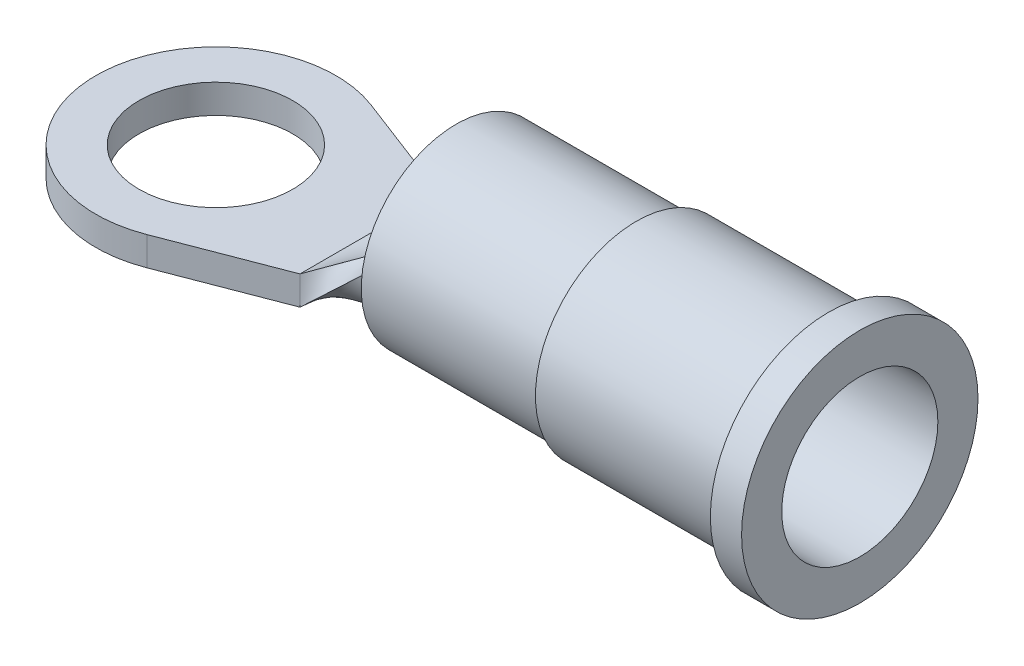
ISO-10303-21;
HEADER;
FILE_DESCRIPTION(('STEP AP214'),'2;1');
FILE_NAME('part.step','',(''),(''),'','','');
FILE_SCHEMA(('AUTOMOTIVE_DESIGN { 1 0 10303 214 1 1 1 1 }'));
ENDSEC;
DATA;
#1=APPLICATION_CONTEXT('core data for automotive mechanical design processes');
#2=APPLICATION_PROTOCOL_DEFINITION('international standard','automotive_design',2000,#1);
#3=PRODUCT_CONTEXT('',#1,'mechanical');
#4=PRODUCT('Part','Part','',(#3));
#5=PRODUCT_RELATED_PRODUCT_CATEGORY('part','',(#4));
#6=PRODUCT_DEFINITION_FORMATION('','',#4);
#7=PRODUCT_DEFINITION_CONTEXT('part definition',#1,'design');
#8=PRODUCT_DEFINITION('design','',#6,#7);
#9=PRODUCT_DEFINITION_SHAPE('','',#8);
#10=(LENGTH_UNIT() NAMED_UNIT(*) SI_UNIT(.MILLI.,.METRE.));
#11=(NAMED_UNIT(*) PLANE_ANGLE_UNIT() SI_UNIT($,.RADIAN.));
#12=(NAMED_UNIT(*) SI_UNIT($,.STERADIAN.) SOLID_ANGLE_UNIT());
#13=UNCERTAINTY_MEASURE_WITH_UNIT(LENGTH_MEASURE(1.E-05),#10,'distance_accuracy_value','');
#14=(GEOMETRIC_REPRESENTATION_CONTEXT(3) GLOBAL_UNCERTAINTY_ASSIGNED_CONTEXT((#13)) GLOBAL_UNIT_ASSIGNED_CONTEXT((#10,
#11,#12)) REPRESENTATION_CONTEXT('',''));
#15=CARTESIAN_POINT('',(0.,0.,0.));
#16=DIRECTION('',(0.,0.,1.));
#17=DIRECTION('',(1.,0.,0.));
#18=AXIS2_PLACEMENT_3D('',#15,#16,#17);
#19=CARTESIAN_POINT('',(6.35,3.65125,0.));
#20=DIRECTION('',(-1.,0.,0.));
#21=DIRECTION('',(0.,0.,1.));
#22=AXIS2_PLACEMENT_3D('',#19,#20,#21);
#23=PLANE('',#22);
#24=CARTESIAN_POINT('',(6.35,1.143,0.));
#25=DIRECTION('',(1.,0.,0.));
#26=DIRECTION('',(0.,0.,-1.));
#27=AXIS2_PLACEMENT_3D('',#24,#25,#26);
#28=CIRCLE('',#27,1.905);
#29=CARTESIAN_POINT('',(6.35,1.143,-1.905));
#30=VERTEX_POINT('',#29);
#31=EDGE_CURVE('E276',#30,#30,#28,.T.);
#32=ORIENTED_EDGE('',*,*,#31,.T.);
#33=EDGE_LOOP('',(#32));
#34=FACE_BOUND('',#33,.T.);
#35=CARTESIAN_POINT('',(6.35,1.143,0.));
#36=DIRECTION('',(1.,0.,0.));
#37=DIRECTION('',(0.,0.,-1.));
#38=AXIS2_PLACEMENT_3D('',#35,#36,#37);
#39=CIRCLE('',#38,2.50825);
#40=CARTESIAN_POINT('',(6.35,1.143,-2.50825));
#41=VERTEX_POINT('',#40);
#42=EDGE_CURVE('E12',#41,#41,#39,.T.);
#43=ORIENTED_EDGE('',*,*,#42,.F.);
#44=EDGE_LOOP('',(#43));
#45=FACE_BOUND('',#44,.T.);
#46=ADVANCED_FACE('F242',(#34,#45),#23,.T.);
#47=CARTESIAN_POINT('',(13.1723727210182,1.143,0.));
#48=DIRECTION('',(1.,0.,0.));
#49=DIRECTION('',(0.,0.,-1.));
#50=AXIS2_PLACEMENT_3D('',#47,#48,#49);
#51=CYLINDRICAL_SURFACE('',#50,2.50825);
#52=ORIENTED_EDGE('',*,*,#42,.T.);
#53=EDGE_LOOP('',(#52));
#54=FACE_BOUND('',#53,.T.);
#55=CARTESIAN_POINT('',(11.1125,1.143,0.));
#56=DIRECTION('',(1.,0.,0.));
#57=DIRECTION('',(0.,0.,-1.));
#58=AXIS2_PLACEMENT_3D('',#55,#56,#57);
#59=CIRCLE('',#58,2.50825);
#60=CARTESIAN_POINT('',(11.1125,1.143,-2.50825));
#61=VERTEX_POINT('',#60);
#62=EDGE_CURVE('E248',#61,#61,#59,.T.);
#63=ORIENTED_EDGE('',*,*,#62,.F.);
#64=EDGE_LOOP('',(#63));
#65=FACE_BOUND('',#64,.T.);
#66=ADVANCED_FACE('F294',(#54,#65),#51,.T.);
#67=CARTESIAN_POINT('',(11.1125,3.81,0.));
#68=DIRECTION('',(-1.,0.,0.));
#69=DIRECTION('',(0.,0.,1.));
#70=AXIS2_PLACEMENT_3D('',#67,#68,#69);
#71=PLANE('',#70);
#72=ORIENTED_EDGE('',*,*,#62,.T.);
#73=EDGE_LOOP('',(#72));
#74=FACE_BOUND('',#73,.T.);
#75=CARTESIAN_POINT('',(11.1125,1.143,0.));
#76=DIRECTION('',(1.,0.,0.));
#77=DIRECTION('',(0.,0.,-1.));
#78=AXIS2_PLACEMENT_3D('',#75,#76,#77);
#79=CIRCLE('',#78,2.667);
#80=CARTESIAN_POINT('',(11.1125,1.143,-2.667));
#81=VERTEX_POINT('',#80);
#82=EDGE_CURVE('E252',#81,#81,#79,.T.);
#83=ORIENTED_EDGE('',*,*,#82,.F.);
#84=EDGE_LOOP('',(#83));
#85=FACE_BOUND('',#84,.T.);
#86=ADVANCED_FACE('F298',(#74,#85),#71,.T.);
#87=CARTESIAN_POINT('',(13.1723727210182,1.143,0.));
#88=DIRECTION('',(1.,0.,0.));
#89=DIRECTION('',(0.,0.,-1.));
#90=AXIS2_PLACEMENT_3D('',#87,#88,#89);
#91=CYLINDRICAL_SURFACE('',#90,2.667);
#92=ORIENTED_EDGE('',*,*,#82,.T.);
#93=EDGE_LOOP('',(#92));
#94=FACE_BOUND('',#93,.T.);
#95=CARTESIAN_POINT('',(16.1925,1.143,0.));
#96=DIRECTION('',(1.,0.,0.));
#97=DIRECTION('',(0.,0.,-1.));
#98=AXIS2_PLACEMENT_3D('',#95,#96,#97);
#99=CIRCLE('',#98,2.667);
#100=CARTESIAN_POINT('',(16.1925,1.143,-2.667));
#101=VERTEX_POINT('',#100);
#102=EDGE_CURVE('E256',#101,#101,#99,.T.);
#103=ORIENTED_EDGE('',*,*,#102,.F.);
#104=EDGE_LOOP('',(#103));
#105=FACE_BOUND('',#104,.T.);
#106=ADVANCED_FACE('F302',(#94,#105),#91,.T.);
#107=CARTESIAN_POINT('',(16.1925,3.81,0.));
#108=DIRECTION('',(-1.,0.,0.));
#109=DIRECTION('',(0.,0.,1.));
#110=AXIS2_PLACEMENT_3D('',#107,#108,#109);
#111=PLANE('',#110);
#112=ORIENTED_EDGE('',*,*,#102,.T.);
#113=EDGE_LOOP('',(#112));
#114=FACE_BOUND('',#113,.T.);
#115=CARTESIAN_POINT('',(16.1925,1.143,0.));
#116=DIRECTION('',(1.,0.,0.));
#117=DIRECTION('',(0.,0.,-1.));
#118=AXIS2_PLACEMENT_3D('',#115,#116,#117);
#119=CIRCLE('',#118,3.1242);
#120=CARTESIAN_POINT('',(16.1925,1.143,-3.1242));
#121=VERTEX_POINT('',#120);
#122=EDGE_CURVE('E261',#121,#121,#119,.T.);
#123=ORIENTED_EDGE('',*,*,#122,.F.);
#124=EDGE_LOOP('',(#123));
#125=FACE_BOUND('',#124,.T.);
#126=ADVANCED_FACE('F308',(#114,#125),#111,.T.);
#127=CARTESIAN_POINT('',(13.1723727210182,1.143,0.));
#128=DIRECTION('',(1.,0.,0.));
#129=DIRECTION('',(0.,0.,-1.));
#130=AXIS2_PLACEMENT_3D('',#127,#128,#129);
#131=CYLINDRICAL_SURFACE('',#130,3.1242);
#132=ORIENTED_EDGE('',*,*,#122,.T.);
#133=EDGE_LOOP('',(#132));
#134=FACE_BOUND('',#133,.T.);
#135=CARTESIAN_POINT('',(17.018,1.143,0.));
#136=DIRECTION('',(1.,0.,0.));
#137=DIRECTION('',(0.,0.,-1.));
#138=AXIS2_PLACEMENT_3D('',#135,#136,#137);
#139=CIRCLE('',#138,3.1242);
#140=CARTESIAN_POINT('',(17.018,1.143,-3.1242));
#141=VERTEX_POINT('',#140);
#142=EDGE_CURVE('E264',#141,#141,#139,.T.);
#143=ORIENTED_EDGE('',*,*,#142,.F.);
#144=EDGE_LOOP('',(#143));
#145=FACE_BOUND('',#144,.T.);
#146=ADVANCED_FACE('F312',(#134,#145),#131,.T.);
#147=CARTESIAN_POINT('',(17.018,3.20675,0.));
#148=DIRECTION('',(1.,0.,0.));
#149=DIRECTION('',(0.,0.,-1.));
#150=AXIS2_PLACEMENT_3D('',#147,#148,#149);
#151=PLANE('',#150);
#152=ORIENTED_EDGE('',*,*,#142,.T.);
#153=EDGE_LOOP('',(#152));
#154=FACE_BOUND('',#153,.T.);
#155=CARTESIAN_POINT('',(17.018,1.143,0.));
#156=DIRECTION('',(1.,0.,0.));
#157=DIRECTION('',(0.,0.,-1.));
#158=AXIS2_PLACEMENT_3D('',#155,#156,#157);
#159=CIRCLE('',#158,2.06375);
#160=CARTESIAN_POINT('',(17.018,1.143,-2.06375));
#161=VERTEX_POINT('',#160);
#162=EDGE_CURVE('E267',#161,#161,#159,.T.);
#163=ORIENTED_EDGE('',*,*,#162,.F.);
#164=EDGE_LOOP('',(#163));
#165=FACE_BOUND('',#164,.T.);
#166=ADVANCED_FACE('F316',(#154,#165),#151,.T.);
#167=CARTESIAN_POINT('',(13.1723727210182,1.143,0.));
#168=DIRECTION('',(1.,0.,0.));
#169=DIRECTION('',(0.,0.,-1.));
#170=AXIS2_PLACEMENT_3D('',#167,#168,#169);
#171=CYLINDRICAL_SURFACE('',#170,2.06375);
#172=ORIENTED_EDGE('',*,*,#162,.T.);
#173=EDGE_LOOP('',(#172));
#174=FACE_BOUND('',#173,.T.);
#175=CARTESIAN_POINT('',(12.7,1.143,0.));
#176=DIRECTION('',(1.,0.,0.));
#177=DIRECTION('',(0.,0.,-1.));
#178=AXIS2_PLACEMENT_3D('',#175,#176,#177);
#179=CIRCLE('',#178,2.06375);
#180=CARTESIAN_POINT('',(12.7,1.143,-2.06375));
#181=VERTEX_POINT('',#180);
#182=EDGE_CURVE('E270',#181,#181,#179,.T.);
#183=ORIENTED_EDGE('',*,*,#182,.F.);
#184=EDGE_LOOP('',(#183));
#185=FACE_BOUND('',#184,.T.);
#186=ADVANCED_FACE('F290',(#174,#185),#171,.F.);
#187=CARTESIAN_POINT('',(12.7,3.048,0.));
#188=DIRECTION('',(1.,0.,0.));
#189=DIRECTION('',(0.,0.,-1.));
#190=AXIS2_PLACEMENT_3D('',#187,#188,#189);
#191=PLANE('',#190);
#192=ORIENTED_EDGE('',*,*,#182,.T.);
#193=EDGE_LOOP('',(#192));
#194=FACE_BOUND('',#193,.T.);
#195=CARTESIAN_POINT('',(12.7,1.143,0.));
#196=DIRECTION('',(1.,0.,0.));
#197=DIRECTION('',(0.,0.,-1.));
#198=AXIS2_PLACEMENT_3D('',#195,#196,#197);
#199=CIRCLE('',#198,1.905);
#200=CARTESIAN_POINT('',(12.7,1.143,-1.905));
#201=VERTEX_POINT('',#200);
#202=EDGE_CURVE('E273',#201,#201,#199,.T.);
#203=ORIENTED_EDGE('',*,*,#202,.F.);
#204=EDGE_LOOP('',(#203));
#205=FACE_BOUND('',#204,.T.);
#206=ADVANCED_FACE('F284',(#194,#205),#191,.T.);
#207=CARTESIAN_POINT('',(13.1723727210182,1.143,0.));
#208=DIRECTION('',(1.,0.,0.));
#209=DIRECTION('',(0.,0.,-1.));
#210=AXIS2_PLACEMENT_3D('',#207,#208,#209);
#211=CYLINDRICAL_SURFACE('',#210,1.905);
#212=ORIENTED_EDGE('',*,*,#202,.T.);
#213=EDGE_LOOP('',(#212));
#214=FACE_BOUND('',#213,.T.);
#215=ORIENTED_EDGE('',*,*,#31,.F.);
#216=EDGE_LOOP('',(#215));
#217=FACE_BOUND('',#216,.T.);
#218=ADVANCED_FACE('F282',(#214,#217),#211,.F.);
#219=CLOSED_SHELL('',(#46,#66,#86,#106,#126,#146,#166,#186,#206,#218));
#220=MANIFOLD_SOLID_BREP('B2',#219);
#221=CARTESIAN_POINT('',(4.064,-0.762,-1.8415));
#222=DIRECTION('',(0.358190515399046,0.,-0.933648517740036));
#223=DIRECTION('',(-0.933648517740036,0.,-0.358190515399046));
#224=AXIS2_PLACEMENT_3D('',#221,#222,#223);
#225=PLANE('',#224);
#226=DIRECTION('',(-0.933648517740036,0.,-0.358190515399046));
#227=VECTOR('',#226,1.);
#228=CARTESIAN_POINT('',(4.064,0.,-1.8415));
#229=LINE('',#228,#227);
#230=CARTESIAN_POINT('',(4.064,0.,-1.8415));
#231=VERTEX_POINT('',#230);
#232=CARTESIAN_POINT('',(1.13725488639197,0.,-2.96433404382461));
#233=VERTEX_POINT('',#232);
#234=EDGE_CURVE('E546',#231,#233,#229,.T.);
#235=ORIENTED_EDGE('',*,*,#234,.F.);
#236=DIRECTION('',(0.,1.,0.));
#237=VECTOR('',#236,1.);
#238=CARTESIAN_POINT('',(4.064,-0.762,-1.8415));
#239=LINE('',#238,#237);
#240=CARTESIAN_POINT('',(4.064,-0.762,-1.8415));
#241=VERTEX_POINT('',#240);
#242=EDGE_CURVE('E240',#241,#231,#239,.T.);
#243=ORIENTED_EDGE('',*,*,#242,.F.);
#244=DIRECTION('',(-0.933648517740036,0.,-0.358190515399046));
#245=VECTOR('',#244,1.);
#246=CARTESIAN_POINT('',(4.064,-0.762,-1.8415));
#247=LINE('',#246,#245);
#248=CARTESIAN_POINT('',(1.13725488639197,-0.762,-2.96433404382461));
#249=VERTEX_POINT('',#248);
#250=EDGE_CURVE('E555',#241,#249,#247,.T.);
#251=ORIENTED_EDGE('',*,*,#250,.T.);
#252=DIRECTION('',(0.,1.,0.));
#253=VECTOR('',#252,1.);
#254=CARTESIAN_POINT('',(1.13725488639197,-0.762,-2.96433404382461));
#255=LINE('',#254,#253);
#256=EDGE_CURVE('E440',#249,#233,#255,.T.);
#257=ORIENTED_EDGE('',*,*,#256,.T.);
#258=EDGE_LOOP('',(#235,#243,#251,#257));
#259=FACE_BOUND('',#258,.T.);
#260=ADVANCED_FACE('F393',(#259),#225,.T.);
#261=CARTESIAN_POINT('',(4.064,-0.762,1.8415));
#262=DIRECTION('',(0.358190515399047,0.,0.933648517740036));
#263=DIRECTION('',(0.933648517740036,0.,-0.358190515399047));
#264=AXIS2_PLACEMENT_3D('',#261,#262,#263);
#265=PLANE('',#264);
#266=DIRECTION('',(0.933648517740036,0.,-0.358190515399047));
#267=VECTOR('',#266,1.);
#268=CARTESIAN_POINT('',(4.064,0.,1.8415));
#269=LINE('',#268,#267);
#270=CARTESIAN_POINT('',(1.13725488639197,0.,2.96433404382461));
#271=VERTEX_POINT('',#270);
#272=CARTESIAN_POINT('',(4.064,0.,1.8415));
#273=VERTEX_POINT('',#272);
#274=EDGE_CURVE('E552',#271,#273,#269,.T.);
#275=ORIENTED_EDGE('',*,*,#274,.F.);
#276=DIRECTION('',(0.,1.,0.));
#277=VECTOR('',#276,1.);
#278=CARTESIAN_POINT('',(1.13725488639197,-0.762,2.96433404382461));
#279=LINE('',#278,#277);
#280=CARTESIAN_POINT('',(1.13725488639197,-0.762,2.96433404382461));
#281=VERTEX_POINT('',#280);
#282=EDGE_CURVE('E557',#281,#271,#279,.T.);
#283=ORIENTED_EDGE('',*,*,#282,.F.);
#284=DIRECTION('',(0.933648517740036,0.,-0.358190515399047));
#285=VECTOR('',#284,1.);
#286=CARTESIAN_POINT('',(4.064,-0.762,1.8415));
#287=LINE('',#286,#285);
#288=CARTESIAN_POINT('',(4.064,-0.762,1.8415));
#289=VERTEX_POINT('',#288);
#290=EDGE_CURVE('E540',#281,#289,#287,.T.);
#291=ORIENTED_EDGE('',*,*,#290,.T.);
#292=DIRECTION('',(0.,1.,0.));
#293=VECTOR('',#292,1.);
#294=CARTESIAN_POINT('',(4.064,-0.762,1.8415));
#295=LINE('',#294,#293);
#296=EDGE_CURVE('E401',#289,#273,#295,.T.);
#297=ORIENTED_EDGE('',*,*,#296,.T.);
#298=EDGE_LOOP('',(#275,#283,#291,#297));
#299=FACE_BOUND('',#298,.T.);
#300=ADVANCED_FACE('F588',(#299),#265,.T.);
#301=CARTESIAN_POINT('',(0.,-0.762,0.));
#302=DIRECTION('',(0.,1.,0.));
#303=DIRECTION('',(0.,0.,1.));
#304=AXIS2_PLACEMENT_3D('',#301,#302,#303);
#305=CYLINDRICAL_SURFACE('',#304,3.175);
#306=CARTESIAN_POINT('',(0.,0.,0.));
#307=DIRECTION('',(0.,1.,0.));
#308=DIRECTION('',(0.,0.,1.));
#309=AXIS2_PLACEMENT_3D('',#306,#307,#308);
#310=CIRCLE('',#309,3.175);
#311=EDGE_CURVE('E549',#233,#271,#310,.T.);
#312=ORIENTED_EDGE('',*,*,#311,.F.);
#313=ORIENTED_EDGE('',*,*,#256,.F.);
#314=CARTESIAN_POINT('',(0.,-0.762,0.));
#315=DIRECTION('',(0.,1.,0.));
#316=DIRECTION('',(0.,0.,1.));
#317=AXIS2_PLACEMENT_3D('',#314,#315,#316);
#318=CIRCLE('',#317,3.175);
#319=EDGE_CURVE('E568',#249,#281,#318,.T.);
#320=ORIENTED_EDGE('',*,*,#319,.T.);
#321=ORIENTED_EDGE('',*,*,#282,.T.);
#322=EDGE_LOOP('',(#312,#313,#320,#321));
#323=FACE_BOUND('',#322,.T.);
#324=ADVANCED_FACE('F558',(#323),#305,.T.);
#325=CARTESIAN_POINT('',(0.,-0.762,0.));
#326=DIRECTION('',(0.,1.,0.));
#327=DIRECTION('',(0.,0.,1.));
#328=AXIS2_PLACEMENT_3D('',#325,#326,#327);
#329=PLANE('',#328);
#330=CARTESIAN_POINT('',(0.,-0.762,0.));
#331=DIRECTION('',(0.,1.,0.));
#332=DIRECTION('',(0.,0.,1.));
#333=AXIS2_PLACEMENT_3D('',#330,#331,#332);
#334=CIRCLE('',#333,2.032);
#335=CARTESIAN_POINT('',(0.,-0.762,2.032));
#336=VERTEX_POINT('',#335);
#337=EDGE_CURVE('E497',#336,#336,#334,.T.);
#338=ORIENTED_EDGE('',*,*,#337,.T.);
#339=EDGE_LOOP('',(#338));
#340=FACE_BOUND('',#339,.T.);
#341=ORIENTED_EDGE('',*,*,#250,.F.);
#342=DIRECTION('',(0.,0.,-1.));
#343=VECTOR('',#342,1.);
#344=CARTESIAN_POINT('',(4.064,-0.762,1.8415));
#345=LINE('',#344,#343);
#346=CARTESIAN_POINT('',(4.064,-0.762,0.));
#347=VERTEX_POINT('',#346);
#348=EDGE_CURVE('E409',#347,#241,#345,.T.);
#349=ORIENTED_EDGE('',*,*,#348,.F.);
#350=DIRECTION('',(0.,0.,-1.));
#351=VECTOR('',#350,1.);
#352=CARTESIAN_POINT('',(4.064,-0.762,-1.8415));
#353=LINE('',#352,#351);
#354=EDGE_CURVE('E537',#289,#347,#353,.T.);
#355=ORIENTED_EDGE('',*,*,#354,.F.);
#356=ORIENTED_EDGE('',*,*,#290,.F.);
#357=ORIENTED_EDGE('',*,*,#319,.F.);
#358=EDGE_LOOP('',(#341,#349,#355,#356,#357));
#359=FACE_BOUND('',#358,.T.);
#360=ADVANCED_FACE('F567',(#340,#359),#329,.F.);
#361=CARTESIAN_POINT('',(0.,0.,0.));
#362=DIRECTION('',(0.,1.,0.));
#363=DIRECTION('',(0.,0.,1.));
#364=AXIS2_PLACEMENT_3D('',#361,#362,#363);
#365=PLANE('',#364);
#366=CARTESIAN_POINT('',(0.,0.,0.));
#367=DIRECTION('',(0.,1.,0.));
#368=DIRECTION('',(0.,0.,1.));
#369=AXIS2_PLACEMENT_3D('',#366,#367,#368);
#370=CIRCLE('',#369,2.032);
#371=CARTESIAN_POINT('',(0.,0.,2.032));
#372=VERTEX_POINT('',#371);
#373=EDGE_CURVE('E493',#372,#372,#370,.T.);
#374=ORIENTED_EDGE('',*,*,#373,.F.);
#375=EDGE_LOOP('',(#374));
#376=FACE_BOUND('',#375,.T.);
#377=ORIENTED_EDGE('',*,*,#234,.T.);
#378=ORIENTED_EDGE('',*,*,#311,.T.);
#379=ORIENTED_EDGE('',*,*,#274,.T.);
#380=DIRECTION('',(0.,0.,-1.));
#381=VECTOR('',#380,1.);
#382=CARTESIAN_POINT('',(4.064,0.,-1.8415));
#383=LINE('',#382,#381);
#384=EDGE_CURVE('E554',#273,#231,#383,.T.);
#385=ORIENTED_EDGE('',*,*,#384,.T.);
#386=EDGE_LOOP('',(#377,#378,#379,#385));
#387=FACE_BOUND('',#386,.T.);
#388=ADVANCED_FACE('F560',(#376,#387),#365,.T.);
#389=CARTESIAN_POINT('',(0.,-0.762,0.));
#390=DIRECTION('',(0.,1.,0.));
#391=DIRECTION('',(0.,0.,1.));
#392=AXIS2_PLACEMENT_3D('',#389,#390,#391);
#393=CYLINDRICAL_SURFACE('',#392,2.032);
#394=CARTESIAN_POINT('',(0.,-0.762,2.032));
#395=CARTESIAN_POINT('',(0.,-0.7540625,2.032));
#396=CARTESIAN_POINT('',(0.,-0.746125,2.032));
#397=CARTESIAN_POINT('',(0.,-0.73025,2.032));
#398=CARTESIAN_POINT('',(0.,-0.7223125,2.032));
#399=CARTESIAN_POINT('',(0.,-0.7064375,2.032));
#400=CARTESIAN_POINT('',(0.,-0.6985,2.032));
#401=CARTESIAN_POINT('',(0.,-0.682625,2.032));
#402=CARTESIAN_POINT('',(0.,-0.6746875,2.032));
#403=CARTESIAN_POINT('',(0.,-0.6588125,2.032));
#404=CARTESIAN_POINT('',(0.,-0.650875,2.032));
#405=CARTESIAN_POINT('',(0.,-0.635,2.032));
#406=CARTESIAN_POINT('',(0.,-0.6270625,2.032));
#407=CARTESIAN_POINT('',(0.,-0.6111875,2.032));
#408=CARTESIAN_POINT('',(0.,-0.60325,2.032));
#409=CARTESIAN_POINT('',(0.,-0.587375,2.032));
#410=CARTESIAN_POINT('',(0.,-0.5794375,2.032));
#411=CARTESIAN_POINT('',(0.,-0.5635625,2.032));
#412=CARTESIAN_POINT('',(0.,-0.555625,2.032));
#413=CARTESIAN_POINT('',(0.,-0.53975,2.032));
#414=CARTESIAN_POINT('',(0.,-0.5318125,2.032));
#415=CARTESIAN_POINT('',(0.,-0.5159375,2.032));
#416=CARTESIAN_POINT('',(0.,-0.508,2.032));
#417=CARTESIAN_POINT('',(0.,-0.492125,2.032));
#418=CARTESIAN_POINT('',(0.,-0.4841875,2.032));
#419=CARTESIAN_POINT('',(0.,-0.4683125,2.032));
#420=CARTESIAN_POINT('',(0.,-0.460375,2.032));
#421=CARTESIAN_POINT('',(0.,-0.4445,2.032));
#422=CARTESIAN_POINT('',(0.,-0.4365625,2.032));
#423=CARTESIAN_POINT('',(0.,-0.4206875,2.032));
#424=CARTESIAN_POINT('',(0.,-0.41275,2.032));
#425=CARTESIAN_POINT('',(0.,-0.396875,2.032));
#426=CARTESIAN_POINT('',(0.,-0.3889375,2.032));
#427=CARTESIAN_POINT('',(0.,-0.3730625,2.032));
#428=CARTESIAN_POINT('',(0.,-0.365125,2.032));
#429=CARTESIAN_POINT('',(0.,-0.34925,2.032));
#430=CARTESIAN_POINT('',(0.,-0.3413125,2.032));
#431=CARTESIAN_POINT('',(0.,-0.3254375,2.032));
#432=CARTESIAN_POINT('',(0.,-0.3175,2.032));
#433=CARTESIAN_POINT('',(0.,-0.301625,2.032));
#434=CARTESIAN_POINT('',(0.,-0.2936875,2.032));
#435=CARTESIAN_POINT('',(0.,-0.2778125,2.032));
#436=CARTESIAN_POINT('',(0.,-0.269875,2.032));
#437=CARTESIAN_POINT('',(0.,-0.254,2.032));
#438=CARTESIAN_POINT('',(0.,-0.2460625,2.032));
#439=CARTESIAN_POINT('',(0.,-0.2301875,2.032));
#440=CARTESIAN_POINT('',(0.,-0.22225,2.032));
#441=CARTESIAN_POINT('',(0.,-0.206375,2.032));
#442=CARTESIAN_POINT('',(0.,-0.1984375,2.032));
#443=CARTESIAN_POINT('',(0.,-0.1825625,2.032));
#444=CARTESIAN_POINT('',(0.,-0.174625,2.032));
#445=CARTESIAN_POINT('',(0.,-0.15875,2.032));
#446=CARTESIAN_POINT('',(0.,-0.1508125,2.032));
#447=CARTESIAN_POINT('',(0.,-0.1349375,2.032));
#448=CARTESIAN_POINT('',(0.,-0.127,2.032));
#449=CARTESIAN_POINT('',(0.,-0.111125,2.032));
#450=CARTESIAN_POINT('',(0.,-0.1031875,2.032));
#451=CARTESIAN_POINT('',(0.,-0.0873125,2.032));
#452=CARTESIAN_POINT('',(0.,-0.079375,2.032));
#453=CARTESIAN_POINT('',(0.,-0.0635,2.032));
#454=CARTESIAN_POINT('',(0.,-0.0555625,2.032));
#455=CARTESIAN_POINT('',(0.,-0.0396875,2.032));
#456=CARTESIAN_POINT('',(0.,-0.03175,2.032));
#457=CARTESIAN_POINT('',(0.,-0.015875,2.032));
#458=CARTESIAN_POINT('',(0.,-0.00793749999999999,2.032));
#459=CARTESIAN_POINT('',(0.,0.,2.032));
#460=B_SPLINE_CURVE_WITH_KNOTS('',3,(#394,#395,#396,#397,#398,#399,#400,#401,#402,#403,#404,
#405,#406,#407,#408,#409,#410,#411,#412,#413,#414,#415,#416,#417,#418,#419,#420,#421,#422,#423,
#424,#425,#426,#427,#428,#429,#430,#431,#432,#433,#434,#435,#436,#437,#438,#439,#440,#441,#442,
#443,#444,#445,#446,#447,#448,#449,#450,#451,#452,#453,#454,#455,#456,#457,#458,#459),
.UNSPECIFIED.,.F.,.F.,(4,2,2,2,2,2,2,2,2,2,2,2,2,2,2,2,2,2,2,2,2,2,2,2,2,2,2,2,2,2,2,2,4),(0.,
0.0238125,0.0476249999999999,0.0714375,0.09525,0.1190625,0.142875,0.1666875,0.1905,0.2143125,
0.238125,0.2619375,0.28575,0.3095625,0.333375,0.3571875,0.381,0.4048125,0.428625,0.4524375,
0.47625,0.5000625,0.523875,0.5476875,0.5715,0.5953125,0.619125,0.6429375,0.66675,0.6905625,
0.714375,0.7381875,0.762),.UNSPECIFIED.);
#461=EDGE_CURVE('BSEAM574',#336,#372,#460,.T.);
#462=ORIENTED_EDGE('',*,*,#337,.F.);
#463=ORIENTED_EDGE('',*,*,#373,.T.);
#464=ORIENTED_EDGE('',*,*,#461,.T.);
#465=ORIENTED_EDGE('',*,*,#461,.F.);
#466=EDGE_LOOP('',(#462,#464,#463,#465));
#467=FACE_BOUND('',#466,.T.);
#468=ADVANCED_FACE('F574',(#467),#393,.F.);
#469=CARTESIAN_POINT('',(6.35,1.397,1.88799073090945));
#470=CARTESIAN_POINT('',(4.064,-0.762,1.8415));
#471=CARTESIAN_POINT('',(6.35,1.397,0.85194189942742));
#472=CARTESIAN_POINT('',(4.064,0.,1.8415));
#473=B_SPLINE_SURFACE_WITH_KNOTS('',1,1,((#469,#470),(#471,#472)),.UNSPECIFIED.,.F.,.F.,.F.,(2,
2),(2,2),(0.,1.),(0.,1.),.UNSPECIFIED.);
#474=DIRECTION('',(0.,0.,-1.));
#475=VECTOR('',#474,1.);
#476=CARTESIAN_POINT('',(6.35,1.397,0.85194189942742));
#477=LINE('',#476,#475);
#478=CARTESIAN_POINT('',(6.35,1.397,1.88799073090945));
#479=VERTEX_POINT('',#478);
#480=CARTESIAN_POINT('',(6.35,1.397,0.85194189942742));
#481=VERTEX_POINT('',#480);
#482=EDGE_CURVE('E472',#479,#481,#477,.T.);
#483=DIRECTION('',(-0.80042535750425,-0.48914882958593,0.346486175162745));
#484=VECTOR('',#483,1.);
#485=CARTESIAN_POINT('',(5.207,0.6985,1.34672094971371));
#486=LINE('',#485,#484);
#487=EDGE_CURVE('E517',#481,#273,#486,.T.);
#488=DIRECTION('',(0.726933700353689,0.686548494778484,0.0147837616151154));
#489=VECTOR('',#488,1.);
#490=CARTESIAN_POINT('',(5.207,0.3175,1.86474536545473));
#491=LINE('',#490,#489);
#492=EDGE_CURVE('E520',#289,#479,#491,.T.);
#493=ORIENTED_EDGE('',*,*,#482,.T.);
#494=ORIENTED_EDGE('',*,*,#487,.T.);
#495=ORIENTED_EDGE('',*,*,#296,.F.);
#496=ORIENTED_EDGE('',*,*,#492,.T.);
#497=EDGE_LOOP('',(#493,#494,#495,#496));
#498=FACE_BOUND('',#497,.T.);
#499=ADVANCED_FACE('F563',(#498),#473,.T.);
#500=CARTESIAN_POINT('',(6.35,1.397,0.85194189942742));
#501=CARTESIAN_POINT('',(4.064,0.,1.8415));
#502=CARTESIAN_POINT('',(6.35,0.774674701094828,1.03748345575673));
#503=CARTESIAN_POINT('',(4.064,0.,1.22766666666667));
#504=CARTESIAN_POINT('',(6.35,0.254,0.649395447152592));
#505=CARTESIAN_POINT('',(4.064,0.,0.613833333333334));
#506=CARTESIAN_POINT('',(6.35,0.254,-0.649395447152592));
#507=CARTESIAN_POINT('',(4.064,0.,-0.613833333333332));
#508=CARTESIAN_POINT('',(6.35,0.774674701094828,-1.03748345575673));
#509=CARTESIAN_POINT('',(4.064,0.,-1.22766666666667));
#510=CARTESIAN_POINT('',(6.35,1.397,-0.85194189942742));
#511=CARTESIAN_POINT('',(4.064,0.,-1.8415));
#512=(BOUNDED_SURFACE() B_SPLINE_SURFACE(3,1,((#500,#501),(#502,#503),(#504,#505),(#506,#507),
(#508,#509),(#510,#511)),.UNSPECIFIED.,.F.,.F.,.F.) B_SPLINE_SURFACE_WITH_KNOTS((4,2,4),(2,2),
(0.,0.5,1.),(0.,1.),
.UNSPECIFIED.) GEOMETRIC_REPRESENTATION_ITEM() RATIONAL_B_SPLINE_SURFACE(((1.,1.),
(0.535447627471135,1.),(0.39180998354162,1.),(0.39180998354162,1.),(0.535447627471135,1.),(1.,1.))) REPRESENTATION_ITEM('') SURFACE());
#513=CARTESIAN_POINT('',(6.35,1.143,0.));
#514=DIRECTION('',(1.,0.,0.));
#515=DIRECTION('',(0.,0.,1.));
#516=AXIS2_PLACEMENT_3D('',#513,#514,#515);
#517=CIRCLE('',#516,0.889);
#518=CARTESIAN_POINT('',(6.35,1.397,-0.85194189942742));
#519=VERTEX_POINT('',#518);
#520=EDGE_CURVE('E494',#481,#519,#517,.T.);
#521=DIRECTION('',(-0.80042535750425,-0.489148829585931,-0.346486175162744));
#522=VECTOR('',#521,1.);
#523=CARTESIAN_POINT('',(5.207,0.6985,-1.34672094971371));
#524=LINE('',#523,#522);
#525=EDGE_CURVE('E492',#519,#231,#524,.T.);
#526=ORIENTED_EDGE('',*,*,#520,.T.);
#527=ORIENTED_EDGE('',*,*,#525,.T.);
#528=ORIENTED_EDGE('',*,*,#384,.F.);
#529=ORIENTED_EDGE('',*,*,#487,.F.);
#530=EDGE_LOOP('',(#526,#527,#528,#529));
#531=FACE_BOUND('',#530,.T.);
#532=ADVANCED_FACE('F562',(#531),#512,.T.);
#533=CARTESIAN_POINT('',(6.35,-0.762,0.));
#534=CARTESIAN_POINT('',(6.223,-0.762,0.));
#535=CARTESIAN_POINT('',(5.969,-0.762,0.));
#536=CARTESIAN_POINT('',(5.588,-0.762,0.));
#537=CARTESIAN_POINT('',(5.207,-0.762,0.));
#538=CARTESIAN_POINT('',(4.826,-0.762,0.));
#539=CARTESIAN_POINT('',(4.445,-0.762,0.));
#540=CARTESIAN_POINT('',(4.191,-0.762,0.));
#541=CARTESIAN_POINT('',(4.064,-0.762,0.));
#542=CARTESIAN_POINT('',(6.35,-0.762,1.23806952954177));
#543=CARTESIAN_POINT('',(6.22235151675704,-0.762,1.19476093167012));
#544=CARTESIAN_POINT('',(5.97802856310718,-0.762,1.11186700076224));
#545=CARTESIAN_POINT('',(5.59505347123573,-0.762,1.00279048510547));
#546=CARTESIAN_POINT('',(5.21095584942315,-0.762,0.900757602869095));
#547=CARTESIAN_POINT('',(4.83252964238074,-0.762,0.798385312551616));
#548=CARTESIAN_POINT('',(4.45234474473457,-0.762,0.701142715140247));
#549=CARTESIAN_POINT('',(4.19049924963176,-0.762,0.642273453700963));
#550=CARTESIAN_POINT('',(4.064,-0.762,0.613833333333334));
#551=CARTESIAN_POINT('',(6.35,0.169984883991446,2.05306666818169));
#552=CARTESIAN_POINT('',(6.18403336246745,0.102321543034656,1.99314153131782));
#553=CARTESIAN_POINT('',(5.86636833379564,-0.0271880829035937,1.87844305575046));
#554=CARTESIAN_POINT('',(5.45351381510528,-0.195505742880399,1.729374761633));
#555=CARTESIAN_POINT('',(5.0718229739977,-0.351118207565545,1.59155865453393));
#556=CARTESIAN_POINT('',(4.70150148527385,-0.502095473404497,1.45784764956731));
#557=CARTESIAN_POINT('',(4.36150904124978,-0.640707817455999,1.33508747292139));
#558=CARTESIAN_POINT('',(4.16091046676191,-0.72249033677924,1.26265787375858));
#559=CARTESIAN_POINT('',(4.064,-0.762,1.22766666666667));
#560=CARTESIAN_POINT('',(6.35,1.397,1.88799073090945));
#561=CARTESIAN_POINT('',(6.223,1.27705555555556,1.88540791252559));
#562=CARTESIAN_POINT('',(5.969,1.03716666666667,1.88024227575788));
#563=CARTESIAN_POINT('',(5.588,0.677333333333333,1.8724938206063));
#564=CARTESIAN_POINT('',(5.207,0.3175,1.86474536545473));
#565=CARTESIAN_POINT('',(4.826,-0.0423333333333334,1.85699691030315));
#566=CARTESIAN_POINT('',(4.445,-0.402166666666667,1.84924845515158));
#567=CARTESIAN_POINT('',(4.191,-0.642055555555555,1.84408281838386));
#568=CARTESIAN_POINT('',(4.064,-0.762,1.8415));
#569=(BOUNDED_SURFACE() B_SPLINE_SURFACE(3,3,((#533,#534,#535,#536,#537,#538,#539,#540,#541),
(#542,#543,#544,#545,#546,#547,#548,#549,#550),(#551,#552,#553,#554,#555,#556,#557,#558,#559),
(#560,#561,#562,#563,#564,#565,#566,#567,#568)),.UNSPECIFIED.,.F.,.F.,
.F.) B_SPLINE_SURFACE_WITH_KNOTS((4,4),(4,1,1,1,1,1,4),(0.5,1.),(0.,0.166666666666667,
0.333333333333333,0.5,0.666666666666667,0.833333333333333,1.),
.UNSPECIFIED.) GEOMETRIC_REPRESENTATION_ITEM() RATIONAL_B_SPLINE_SURFACE(((1.,1.,1.,1.,1.,1.,1.,
1.,1.),(0.772187059069589,0.772187059069589,0.79496835316263,0.851921588395233,
0.886093529534795,0.920265470674356,0.977218705906959,1.,1.),(0.772187059069589,
0.772187059069589,0.79496835316263,0.851921588395233,0.886093529534795,0.920265470674356,
0.977218705906959,1.,1.),(1.,1.,1.,1.,1.,1.,1.,1.,1.))) REPRESENTATION_ITEM('') SURFACE());
#570=CARTESIAN_POINT('',(6.35,1.143,0.));
#571=DIRECTION('',(-1.,0.,0.));
#572=DIRECTION('',(0.,0.,1.));
#573=AXIS2_PLACEMENT_3D('',#570,#571,#572);
#574=CIRCLE('',#573,1.905);
#575=CARTESIAN_POINT('',(6.35,-0.762,0.));
#576=VERTEX_POINT('',#575);
#577=EDGE_CURVE('E468',#576,#479,#574,.T.);
#578=DIRECTION('',(-1.,0.,0.));
#579=VECTOR('',#578,1.);
#580=CARTESIAN_POINT('',(5.207,-0.762,0.));
#581=LINE('',#580,#579);
#582=EDGE_CURVE('E487',#576,#347,#581,.T.);
#583=ORIENTED_EDGE('',*,*,#577,.T.);
#584=ORIENTED_EDGE('',*,*,#492,.F.);
#585=ORIENTED_EDGE('',*,*,#354,.T.);
#586=ORIENTED_EDGE('',*,*,#582,.F.);
#587=EDGE_LOOP('',(#583,#584,#585,#586));
#588=FACE_BOUND('',#587,.T.);
#589=ADVANCED_FACE('F565',(#588),#569,.T.);
#590=CARTESIAN_POINT('',(6.35,1.397,-1.88799073090945));
#591=CARTESIAN_POINT('',(6.223,1.27705555555556,-1.88540791252559));
#592=CARTESIAN_POINT('',(5.969,1.03716666666667,-1.88024227575787));
#593=CARTESIAN_POINT('',(5.588,0.677333333333333,-1.8724938206063));
#594=CARTESIAN_POINT('',(5.207,0.3175,-1.86474536545473));
#595=CARTESIAN_POINT('',(4.826,-0.0423333333333333,-1.85699691030315));
#596=CARTESIAN_POINT('',(4.445,-0.402166666666667,-1.84924845515158));
#597=CARTESIAN_POINT('',(4.191,-0.642055555555555,-1.84408281838386));
#598=CARTESIAN_POINT('',(4.064,-0.762,-1.8415));
#599=CARTESIAN_POINT('',(6.35,0.169984883991446,-2.05306666818169));
#600=CARTESIAN_POINT('',(6.18403336246745,0.102321543034656,-1.99314153131782));
#601=CARTESIAN_POINT('',(5.86636833379564,-0.0271880829035936,-1.87844305575046));
#602=CARTESIAN_POINT('',(5.45351381510528,-0.195505742880398,-1.729374761633));
#603=CARTESIAN_POINT('',(5.0718229739977,-0.351118207565545,-1.59155865453394));
#604=CARTESIAN_POINT('',(4.70150148527385,-0.502095473404497,-1.45784764956731));
#605=CARTESIAN_POINT('',(4.36150904124978,-0.640707817455999,-1.33508747292139));
#606=CARTESIAN_POINT('',(4.16091046676191,-0.72249033677924,-1.26265787375857));
#607=CARTESIAN_POINT('',(4.064,-0.762,-1.22766666666667));
#608=CARTESIAN_POINT('',(6.35,-0.762,-1.23806952954178));
#609=CARTESIAN_POINT('',(6.22235151675704,-0.762,-1.19476093167012));
#610=CARTESIAN_POINT('',(5.97802856310718,-0.762,-1.11186700076224));
#611=CARTESIAN_POINT('',(5.59505347123574,-0.762,-1.00279048510548));
#612=CARTESIAN_POINT('',(5.21095584942314,-0.762,-0.900757602869096));
#613=CARTESIAN_POINT('',(4.83252964238074,-0.762,-0.798385312551616));
#614=CARTESIAN_POINT('',(4.45234474473457,-0.762,-0.701142715140247));
#615=CARTESIAN_POINT('',(4.19049924963176,-0.762,-0.642273453700963));
#616=CARTESIAN_POINT('',(4.064,-0.762,-0.613833333333333));
#617=CARTESIAN_POINT('',(6.35,-0.762,0.));
#618=CARTESIAN_POINT('',(6.223,-0.762,0.));
#619=CARTESIAN_POINT('',(5.969,-0.762,0.));
#620=CARTESIAN_POINT('',(5.588,-0.762,0.));
#621=CARTESIAN_POINT('',(5.207,-0.762,0.));
#622=CARTESIAN_POINT('',(4.826,-0.762,0.));
#623=CARTESIAN_POINT('',(4.445,-0.762,0.));
#624=CARTESIAN_POINT('',(4.191,-0.762,0.));
#625=CARTESIAN_POINT('',(4.064,-0.762,0.));
#626=(BOUNDED_SURFACE() B_SPLINE_SURFACE(3,3,((#590,#591,#592,#593,#594,#595,#596,#597,#598),
(#599,#600,#601,#602,#603,#604,#605,#606,#607),(#608,#609,#610,#611,#612,#613,#614,#615,#616),
(#617,#618,#619,#620,#621,#622,#623,#624,#625)),.UNSPECIFIED.,.F.,.F.,
.F.) B_SPLINE_SURFACE_WITH_KNOTS((4,4),(4,1,1,1,1,1,4),(0.,0.5),(0.,0.166666666666667,
0.333333333333333,0.5,0.666666666666667,0.833333333333333,1.),
.UNSPECIFIED.) GEOMETRIC_REPRESENTATION_ITEM() RATIONAL_B_SPLINE_SURFACE(((1.,1.,1.,1.,1.,1.,1.,
1.,1.),(0.772187059069589,0.772187059069589,0.79496835316263,0.851921588395233,
0.886093529534795,0.920265470674356,0.977218705906959,1.,1.),(0.772187059069589,
0.772187059069589,0.79496835316263,0.851921588395233,0.886093529534795,0.920265470674356,
0.977218705906959,1.,1.),(1.,1.,1.,1.,1.,1.,1.,1.,1.))) REPRESENTATION_ITEM('') SURFACE());
#627=CARTESIAN_POINT('',(6.35,1.397,-1.88799073090945));
#628=VERTEX_POINT('',#627);
#629=EDGE_CURVE('E463',#628,#576,#574,.T.);
#630=DIRECTION('',(-0.726933700353688,-0.686548494778483,0.0147837616151159));
#631=VECTOR('',#630,1.);
#632=CARTESIAN_POINT('',(5.207,0.3175,-1.86474536545472));
#633=LINE('',#632,#631);
#634=EDGE_CURVE('E484',#628,#241,#633,.T.);
#635=ORIENTED_EDGE('',*,*,#629,.T.);
#636=ORIENTED_EDGE('',*,*,#582,.T.);
#637=ORIENTED_EDGE('',*,*,#348,.T.);
#638=ORIENTED_EDGE('',*,*,#634,.F.);
#639=EDGE_LOOP('',(#635,#636,#637,#638));
#640=FACE_BOUND('',#639,.T.);
#641=ADVANCED_FACE('F485',(#640),#626,.T.);
#642=CARTESIAN_POINT('',(6.35,1.397,-0.85194189942742));
#643=CARTESIAN_POINT('',(4.064,0.,-1.8415));
#644=CARTESIAN_POINT('',(6.35,1.397,-1.88799073090945));
#645=CARTESIAN_POINT('',(4.064,-0.762,-1.8415));
#646=B_SPLINE_SURFACE_WITH_KNOTS('',1,1,((#642,#643),(#644,#645)),.UNSPECIFIED.,.F.,.F.,.F.,(2,
2),(2,2),(0.,1.),(0.,1.),.UNSPECIFIED.);
#647=DIRECTION('',(0.,0.,-1.));
#648=VECTOR('',#647,1.);
#649=CARTESIAN_POINT('',(6.35,1.397,-1.88799073090945));
#650=LINE('',#649,#648);
#651=EDGE_CURVE('E477',#519,#628,#650,.T.);
#652=ORIENTED_EDGE('',*,*,#651,.T.);
#653=ORIENTED_EDGE('',*,*,#634,.T.);
#654=ORIENTED_EDGE('',*,*,#242,.T.);
#655=ORIENTED_EDGE('',*,*,#525,.F.);
#656=EDGE_LOOP('',(#652,#653,#654,#655));
#657=FACE_BOUND('',#656,.T.);
#658=ADVANCED_FACE('F490',(#657),#646,.T.);
#659=CARTESIAN_POINT('',(12.7,1.143,0.));
#660=DIRECTION('',(1.,0.,0.));
#661=DIRECTION('',(0.,0.,-1.));
#662=AXIS2_PLACEMENT_3D('',#659,#660,#661);
#663=PLANE('',#662);
#664=CARTESIAN_POINT('',(12.7,1.143,0.));
#665=DIRECTION('',(1.,0.,0.));
#666=DIRECTION('',(0.,0.,-1.));
#667=AXIS2_PLACEMENT_3D('',#664,#665,#666);
#668=CIRCLE('',#667,1.905);
#669=CARTESIAN_POINT('',(12.7,1.143,-1.905));
#670=VERTEX_POINT('',#669);
#671=EDGE_CURVE('E480',#670,#670,#668,.T.);
#672=ORIENTED_EDGE('',*,*,#671,.T.);
#673=EDGE_LOOP('',(#672));
#674=FACE_BOUND('',#673,.T.);
#675=CARTESIAN_POINT('',(12.7,1.143,0.));
#676=DIRECTION('',(1.,0.,0.));
#677=DIRECTION('',(0.,0.,-1.));
#678=AXIS2_PLACEMENT_3D('',#675,#676,#677);
#679=CIRCLE('',#678,0.889);
#680=CARTESIAN_POINT('',(12.7,1.143,-0.889));
#681=VERTEX_POINT('',#680);
#682=EDGE_CURVE('E481',#681,#681,#679,.T.);
#683=ORIENTED_EDGE('',*,*,#682,.F.);
#684=EDGE_LOOP('',(#683));
#685=FACE_BOUND('',#684,.T.);
#686=ADVANCED_FACE('F651',(#674,#685),#663,.T.);
#687=CARTESIAN_POINT('',(6.35,1.143,0.));
#688=DIRECTION('',(1.,0.,0.));
#689=DIRECTION('',(0.,0.,-1.));
#690=AXIS2_PLACEMENT_3D('',#687,#688,#689);
#691=PLANE('',#690);
#692=ORIENTED_EDGE('',*,*,#651,.F.);
#693=CARTESIAN_POINT('',(6.35,1.143,0.));
#694=DIRECTION('',(1.,0.,0.));
#695=DIRECTION('',(0.,0.,-1.));
#696=AXIS2_PLACEMENT_3D('',#693,#694,#695);
#697=CIRCLE('',#696,0.889);
#698=EDGE_CURVE('E729',#519,#481,#697,.T.);
#699=ORIENTED_EDGE('',*,*,#698,.T.);
#700=ORIENTED_EDGE('',*,*,#482,.F.);
#701=CARTESIAN_POINT('',(6.35,1.143,0.));
#702=DIRECTION('',(1.,0.,0.));
#703=DIRECTION('',(0.,0.,-1.));
#704=AXIS2_PLACEMENT_3D('',#701,#702,#703);
#705=CIRCLE('',#704,1.905);
#706=EDGE_CURVE('E466',#628,#479,#705,.T.);
#707=ORIENTED_EDGE('',*,*,#706,.F.);
#708=EDGE_LOOP('',(#692,#699,#700,#707));
#709=FACE_BOUND('',#708,.T.);
#710=ADVANCED_FACE('F475',(#709),#691,.F.);
#711=CARTESIAN_POINT('',(12.7,1.143,0.));
#712=DIRECTION('',(-1.,0.,0.));
#713=DIRECTION('',(0.,0.,1.));
#714=AXIS2_PLACEMENT_3D('',#711,#712,#713);
#715=CYLINDRICAL_SURFACE('',#714,1.905);
#716=ORIENTED_EDGE('',*,*,#671,.F.);
#717=EDGE_LOOP('',(#716));
#718=FACE_BOUND('',#717,.T.);
#719=ORIENTED_EDGE('',*,*,#706,.T.);
#720=ORIENTED_EDGE('',*,*,#577,.F.);
#721=ORIENTED_EDGE('',*,*,#629,.F.);
#722=EDGE_LOOP('',(#719,#720,#721));
#723=FACE_BOUND('',#722,.T.);
#724=ADVANCED_FACE('F465',(#718,#723),#715,.T.);
#725=CARTESIAN_POINT('',(12.7,1.143,0.));
#726=DIRECTION('',(-1.,0.,0.));
#727=DIRECTION('',(0.,0.,1.));
#728=AXIS2_PLACEMENT_3D('',#725,#726,#727);
#729=CYLINDRICAL_SURFACE('',#728,0.889);
#730=ORIENTED_EDGE('',*,*,#682,.T.);
#731=EDGE_LOOP('',(#730));
#732=FACE_BOUND('',#731,.T.);
#733=ORIENTED_EDGE('',*,*,#698,.F.);
#734=ORIENTED_EDGE('',*,*,#520,.F.);
#735=EDGE_LOOP('',(#733,#734));
#736=FACE_BOUND('',#735,.T.);
#737=ADVANCED_FACE('F677',(#732,#736),#729,.F.);
#738=CLOSED_SHELL('',(#260,#300,#324,#360,#388,#468,#499,#532,#589,#641,#658,#686,#710,#724,#737));
#739=MANIFOLD_SOLID_BREP('B7',#738);
#740=ADVANCED_BREP_SHAPE_REPRESENTATION('',(#18,#220,#739),#14);
#741=SHAPE_DEFINITION_REPRESENTATION(#9,#740);
ENDSEC;
END-ISO-10303-21;
